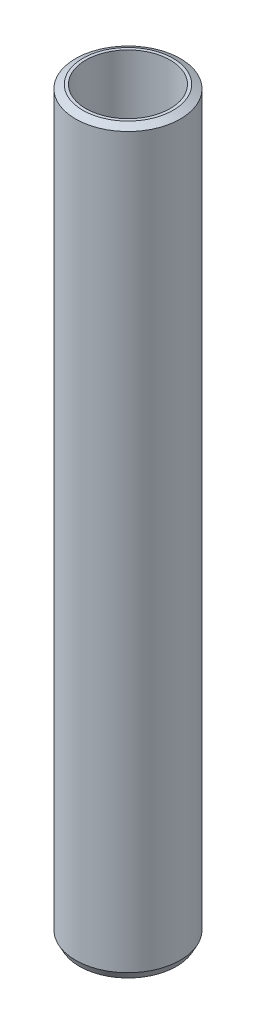
ISO-10303-21;
HEADER;
FILE_DESCRIPTION(('STEP AP214'),'2;1');
FILE_NAME('part.step','',(''),(''),'','','');
FILE_SCHEMA(('AUTOMOTIVE_DESIGN { 1 0 10303 214 1 1 1 1 }'));
ENDSEC;
DATA;
#1=APPLICATION_CONTEXT('core data for automotive mechanical design processes');
#2=APPLICATION_PROTOCOL_DEFINITION('international standard','automotive_design',2000,#1);
#3=PRODUCT_CONTEXT('',#1,'mechanical');
#4=PRODUCT('Part','Part','',(#3));
#5=PRODUCT_RELATED_PRODUCT_CATEGORY('part','',(#4));
#6=PRODUCT_DEFINITION_FORMATION('','',#4);
#7=PRODUCT_DEFINITION_CONTEXT('part definition',#1,'design');
#8=PRODUCT_DEFINITION('design','',#6,#7);
#9=PRODUCT_DEFINITION_SHAPE('','',#8);
#10=(LENGTH_UNIT() NAMED_UNIT(*) SI_UNIT(.MILLI.,.METRE.));
#11=(NAMED_UNIT(*) PLANE_ANGLE_UNIT() SI_UNIT($,.RADIAN.));
#12=(NAMED_UNIT(*) SI_UNIT($,.STERADIAN.) SOLID_ANGLE_UNIT());
#13=UNCERTAINTY_MEASURE_WITH_UNIT(LENGTH_MEASURE(1.E-05),#10,'distance_accuracy_value','');
#14=(GEOMETRIC_REPRESENTATION_CONTEXT(3) GLOBAL_UNCERTAINTY_ASSIGNED_CONTEXT((#13)) GLOBAL_UNIT_ASSIGNED_CONTEXT((#10,
#11,#12)) REPRESENTATION_CONTEXT('',''));
#15=CARTESIAN_POINT('',(0.,0.,0.));
#16=DIRECTION('',(0.,0.,1.));
#17=DIRECTION('',(1.,0.,0.));
#18=AXIS2_PLACEMENT_3D('',#15,#16,#17);
#19=CARTESIAN_POINT('',(0.,600.,0.));
#20=DIRECTION('',(0.,-1.,0.));
#21=DIRECTION('',(0.,0.,-1.));
#22=AXIS2_PLACEMENT_3D('',#19,#20,#21);
#23=CYLINDRICAL_SURFACE('',#22,42.5);
#24=CARTESIAN_POINT('',(0.,596.85757383748,0.));
#25=DIRECTION('',(0.,1.,0.));
#26=DIRECTION('',(0.,0.,1.));
#27=AXIS2_PLACEMENT_3D('',#24,#25,#26);
#28=CIRCLE('',#27,42.5);
#29=CARTESIAN_POINT('',(0.,596.85757383748,42.5));
#30=VERTEX_POINT('',#29);
#31=EDGE_CURVE('E50',#30,#30,#28,.F.);
#32=ORIENTED_EDGE('',*,*,#31,.T.);
#33=EDGE_LOOP('',(#32));
#34=FACE_BOUND('',#33,.T.);
#35=CARTESIAN_POINT('',(0.,5.91799909438384,0.));
#36=DIRECTION('',(0.,1.,0.));
#37=DIRECTION('',(0.,0.,1.));
#38=AXIS2_PLACEMENT_3D('',#35,#36,#37);
#39=CIRCLE('',#38,42.5);
#40=CARTESIAN_POINT('',(0.,5.91799909438384,42.5));
#41=VERTEX_POINT('',#40);
#42=EDGE_CURVE('E51',#41,#41,#39,.T.);
#43=ORIENTED_EDGE('',*,*,#42,.T.);
#44=EDGE_LOOP('',(#43));
#45=FACE_BOUND('',#44,.T.);
#46=ADVANCED_FACE('F39',(#34,#45),#23,.T.);
#47=CARTESIAN_POINT('',(0.,600.,0.));
#48=DIRECTION('',(0.,1.,0.));
#49=DIRECTION('',(0.,0.,1.));
#50=AXIS2_PLACEMENT_3D('',#47,#48,#49);
#51=PLANE('',#50);
#52=CARTESIAN_POINT('',(0.,600.,0.));
#53=DIRECTION('',(0.,1.,0.));
#54=DIRECTION('',(0.,0.,1.));
#55=AXIS2_PLACEMENT_3D('',#52,#53,#54);
#56=CIRCLE('',#55,36.5820009056156);
#57=CARTESIAN_POINT('',(0.,600.,36.5820009056156));
#58=VERTEX_POINT('',#57);
#59=EDGE_CURVE('E54',#58,#58,#56,.T.);
#60=ORIENTED_EDGE('',*,*,#59,.T.);
#61=EDGE_LOOP('',(#60));
#62=FACE_BOUND('',#61,.T.);
#63=CARTESIAN_POINT('',(0.,600.,0.));
#64=DIRECTION('',(0.,1.,0.));
#65=DIRECTION('',(0.,0.,1.));
#66=AXIS2_PLACEMENT_3D('',#63,#64,#65);
#67=CIRCLE('',#66,34.1785940837728);
#68=CARTESIAN_POINT('',(0.,600.,34.1785940837728));
#69=VERTEX_POINT('',#68);
#70=EDGE_CURVE('E58',#69,#69,#67,.T.);
#71=ORIENTED_EDGE('',*,*,#70,.F.);
#72=EDGE_LOOP('',(#71));
#73=FACE_BOUND('',#72,.T.);
#74=ADVANCED_FACE('F69',(#62,#73),#51,.T.);
#75=CARTESIAN_POINT('',(0.,0.,0.));
#76=DIRECTION('',(0.,1.,0.));
#77=DIRECTION('',(0.,0.,1.));
#78=AXIS2_PLACEMENT_3D('',#75,#76,#77);
#79=PLANE('',#78);
#80=CARTESIAN_POINT('',(0.,0.,0.));
#81=DIRECTION('',(0.,1.,0.));
#82=DIRECTION('',(0.,0.,1.));
#83=AXIS2_PLACEMENT_3D('',#80,#81,#82);
#84=CIRCLE('',#83,39.3575738374807);
#85=CARTESIAN_POINT('',(0.,0.,39.3575738374807));
#86=VERTEX_POINT('',#85);
#87=EDGE_CURVE('E10',#86,#86,#84,.F.);
#88=ORIENTED_EDGE('',*,*,#87,.T.);
#89=EDGE_LOOP('',(#88));
#90=FACE_BOUND('',#89,.T.);
#91=CARTESIAN_POINT('',(0.,0.,0.));
#92=DIRECTION('',(0.,1.,0.));
#93=DIRECTION('',(0.,0.,1.));
#94=AXIS2_PLACEMENT_3D('',#91,#92,#93);
#95=CIRCLE('',#94,34.1785940837728);
#96=CARTESIAN_POINT('',(0.,0.,34.1785940837728));
#97=VERTEX_POINT('',#96);
#98=EDGE_CURVE('E63',#97,#97,#95,.T.);
#99=ORIENTED_EDGE('',*,*,#98,.T.);
#100=EDGE_LOOP('',(#99));
#101=FACE_BOUND('',#100,.T.);
#102=ADVANCED_FACE('F75',(#90,#101),#79,.F.);
#103=CARTESIAN_POINT('',(0.,600.,0.));
#104=DIRECTION('',(0.,-1.,0.));
#105=DIRECTION('',(0.,0.,-1.));
#106=AXIS2_PLACEMENT_3D('',#103,#104,#105);
#107=CYLINDRICAL_SURFACE('',#106,34.1785940837728);
#108=ORIENTED_EDGE('',*,*,#70,.T.);
#109=EDGE_LOOP('',(#108));
#110=FACE_BOUND('',#109,.T.);
#111=ORIENTED_EDGE('',*,*,#98,.F.);
#112=EDGE_LOOP('',(#111));
#113=FACE_BOUND('',#112,.T.);
#114=ADVANCED_FACE('F70',(#110,#113),#107,.F.);
#115=CARTESIAN_POINT('',(0.,600.,0.));
#116=DIRECTION('',(0.,-1.,0.));
#117=DIRECTION('',(0.,0.,-1.));
#118=AXIS2_PLACEMENT_3D('',#115,#116,#117);
#119=CONICAL_SURFACE('',#118,36.5820009056156,1.08266150241759);
#120=ORIENTED_EDGE('',*,*,#31,.F.);
#121=EDGE_LOOP('',(#120));
#122=FACE_BOUND('',#121,.T.);
#123=ORIENTED_EDGE('',*,*,#59,.F.);
#124=EDGE_LOOP('',(#123));
#125=FACE_BOUND('',#124,.T.);
#126=ADVANCED_FACE('F81',(#122,#125),#119,.T.);
#127=CARTESIAN_POINT('',(0.,5.91799909438384,0.));
#128=DIRECTION('',(0.,1.,0.));
#129=DIRECTION('',(0.,0.,1.));
#130=AXIS2_PLACEMENT_3D('',#127,#128,#129);
#131=CONICAL_SURFACE('',#130,42.5,0.48813482437733);
#132=CARTESIAN_POINT('',(0.,0.,39.3575738374807));
#133=CARTESIAN_POINT('',(0.,0.0616458238998322,39.3903074433402));
#134=CARTESIAN_POINT('',(0.,0.123291647799663,39.4230410491998));
#135=CARTESIAN_POINT('',(0.,0.246583295599326,39.488508260919));
#136=CARTESIAN_POINT('',(0.,0.308229119499157,39.5212418667786));
#137=CARTESIAN_POINT('',(0.,0.43152076729882,39.5867090784977));
#138=CARTESIAN_POINT('',(0.,0.493166591198652,39.6194426843573));
#139=CARTESIAN_POINT('',(0.,0.616458238998316,39.6849098960764));
#140=CARTESIAN_POINT('',(0.,0.678104062898148,39.717643501936));
#141=CARTESIAN_POINT('',(0.,0.801395710697811,39.7831107136552));
#142=CARTESIAN_POINT('',(0.,0.863041534597642,39.8158443195147));
#143=CARTESIAN_POINT('',(0.,0.986333182397305,39.8813115312339));
#144=CARTESIAN_POINT('',(0.,1.04797900629714,39.9140451370935));
#145=CARTESIAN_POINT('',(0.,1.1712706540968,39.9795123488126));
#146=CARTESIAN_POINT('',(0.,1.23291647799663,40.0122459546722));
#147=CARTESIAN_POINT('',(0.,1.3562081257963,40.0777131663914));
#148=CARTESIAN_POINT('',(0.,1.41785394969613,40.1104467722509));
#149=CARTESIAN_POINT('',(0.,1.54114559749579,40.1759139839701));
#150=CARTESIAN_POINT('',(0.,1.60279142139562,40.2086475898297));
#151=CARTESIAN_POINT('',(0.,1.72608306919529,40.2741148015488));
#152=CARTESIAN_POINT('',(0.,1.78772889309512,40.3068484074084));
#153=CARTESIAN_POINT('',(0.,1.91102054089478,40.3723156191275));
#154=CARTESIAN_POINT('',(0.,1.97266636479461,40.4050492249871));
#155=CARTESIAN_POINT('',(0.,2.09595801259428,40.4705164367063));
#156=CARTESIAN_POINT('',(0.,2.15760383649411,40.5032500425658));
#157=CARTESIAN_POINT('',(0.,2.28089548429377,40.568717254285));
#158=CARTESIAN_POINT('',(0.,2.3425413081936,40.6014508601446));
#159=CARTESIAN_POINT('',(0.,2.46583295599327,40.6669180718637));
#160=CARTESIAN_POINT('',(0.,2.5274787798931,40.6996516777233));
#161=CARTESIAN_POINT('',(0.,2.65077042769276,40.7651188894425));
#162=CARTESIAN_POINT('',(0.,2.71241625159259,40.797852495302));
#163=CARTESIAN_POINT('',(0.,2.83570789939226,40.8633197070212));
#164=CARTESIAN_POINT('',(0.,2.89735372329209,40.8960533128808));
#165=CARTESIAN_POINT('',(0.,3.02064537109175,40.9615205245999));
#166=CARTESIAN_POINT('',(0.,3.08229119499158,40.9942541304595));
#167=CARTESIAN_POINT('',(0.,3.20558284279125,41.0597213421786));
#168=CARTESIAN_POINT('',(0.,3.26722866669108,41.0924549480382));
#169=CARTESIAN_POINT('',(0.,3.39052031449074,41.1579221597574));
#170=CARTESIAN_POINT('',(0.,3.45216613839057,41.190655765617));
#171=CARTESIAN_POINT('',(0.,3.57545778619024,41.2561229773361));
#172=CARTESIAN_POINT('',(0.,3.63710361009007,41.2888565831957));
#173=CARTESIAN_POINT('',(0.,3.76039525788973,41.3543237949148));
#174=CARTESIAN_POINT('',(0.,3.82204108178956,41.3870574007744));
#175=CARTESIAN_POINT('',(0.,3.94533272958923,41.4525246124936));
#176=CARTESIAN_POINT('',(0.,4.00697855348906,41.4852582183531));
#177=CARTESIAN_POINT('',(0.,4.13027020128872,41.5507254300723));
#178=CARTESIAN_POINT('',(0.,4.19191602518855,41.5834590359319));
#179=CARTESIAN_POINT('',(0.,4.31520767298822,41.648926247651));
#180=CARTESIAN_POINT('',(0.,4.37685349688805,41.6816598535106));
#181=CARTESIAN_POINT('',(0.,4.50014514468771,41.7471270652298));
#182=CARTESIAN_POINT('',(0.,4.56179096858754,41.7798606710893));
#183=CARTESIAN_POINT('',(0.,4.68508261638721,41.8453278828085));
#184=CARTESIAN_POINT('',(0.,4.74672844028704,41.8780614886681));
#185=CARTESIAN_POINT('',(0.,4.8700200880867,41.9435287003872));
#186=CARTESIAN_POINT('',(0.,4.93166591198653,41.9762623062468));
#187=CARTESIAN_POINT('',(0.,5.0549575597862,42.0417295179659));
#188=CARTESIAN_POINT('',(0.,5.11660338368603,42.0744631238255));
#189=CARTESIAN_POINT('',(0.,5.23989503148569,42.1399303355447));
#190=CARTESIAN_POINT('',(0.,5.30154085538552,42.1726639414042));
#191=CARTESIAN_POINT('',(0.,5.42483250318519,42.2381311531234));
#192=CARTESIAN_POINT('',(0.,5.48647832708502,42.270864758983));
#193=CARTESIAN_POINT('',(0.,5.60976997488468,42.3363319707021));
#194=CARTESIAN_POINT('',(0.,5.67141579878451,42.3690655765617));
#195=CARTESIAN_POINT('',(0.,5.79470744658418,42.4345327882809));
#196=CARTESIAN_POINT('',(0.,5.85635327048401,42.4672663941404));
#197=CARTESIAN_POINT('',(0.,5.91799909438384,42.5));
#198=B_SPLINE_CURVE_WITH_KNOTS('',3,(#132,#133,#134,#135,#136,#137,#138,#139,#140,#141,#142,
#143,#144,#145,#146,#147,#148,#149,#150,#151,#152,#153,#154,#155,#156,#157,#158,#159,#160,#161,
#162,#163,#164,#165,#166,#167,#168,#169,#170,#171,#172,#173,#174,#175,#176,#177,#178,#179,#180,
#181,#182,#183,#184,#185,#186,#187,#188,#189,#190,#191,#192,#193,#194,#195,#196,#197),
.UNSPECIFIED.,.F.,.F.,(4,2,2,2,2,2,2,2,2,2,2,2,2,2,2,2,2,2,2,2,2,2,2,2,2,2,2,2,2,2,2,2,4),(0.,
0.209392619286669,0.418785238573341,0.62817785786001,0.837570477146679,1.04696309643335,
1.25635571572002,1.46574833500669,1.67514095429336,1.88453357358003,2.0939261928667,
2.30331881215337,2.51271143144004,2.72210405072671,2.93149667001338,3.14088928930005,
3.35028190858672,3.55967452787339,3.76906714716006,3.97845976644673,4.1878523857334,
4.39724500502007,4.60663762430674,4.81603024359341,5.02542286288008,5.23481548216675,
5.44420810145343,5.65360072074009,5.86299334002676,6.07238595931344,6.2817785786001,
6.49117119788678,6.70056381717345),.UNSPECIFIED.);
#199=EDGE_CURVE('BSEAM45',#86,#41,#198,.T.);
#200=ORIENTED_EDGE('',*,*,#87,.F.);
#201=ORIENTED_EDGE('',*,*,#42,.F.);
#202=ORIENTED_EDGE('',*,*,#199,.T.);
#203=ORIENTED_EDGE('',*,*,#199,.F.);
#204=EDGE_LOOP('',(#200,#202,#201,#203));
#205=FACE_BOUND('',#204,.T.);
#206=ADVANCED_FACE('F45',(#205),#131,.T.);
#207=CLOSED_SHELL('',(#46,#74,#102,#114,#126,#206));
#208=MANIFOLD_SOLID_BREP('B2',#207);
#209=ADVANCED_BREP_SHAPE_REPRESENTATION('',(#18,#208),#14);
#210=SHAPE_DEFINITION_REPRESENTATION(#9,#209);
ENDSEC;
END-ISO-10303-21;
